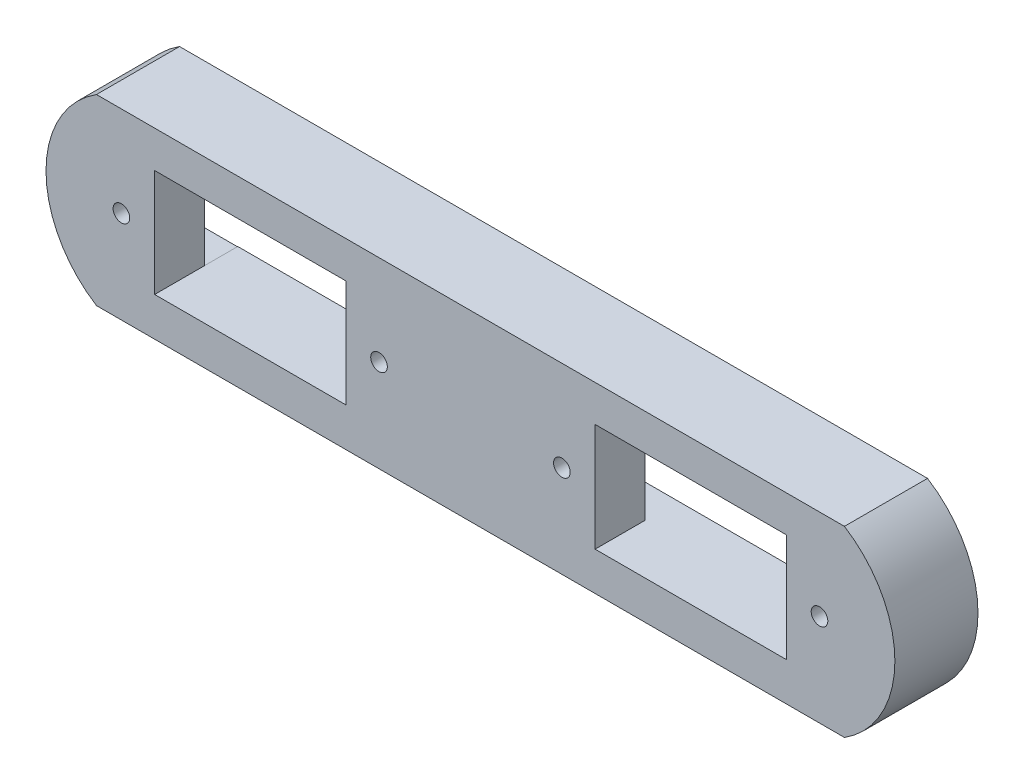
ISO-10303-21;
HEADER;
FILE_DESCRIPTION(('STEP AP214'),'2;1');
FILE_NAME('part.step','',(''),(''),'','','');
FILE_SCHEMA(('AUTOMOTIVE_DESIGN { 1 0 10303 214 1 1 1 1 }'));
ENDSEC;
DATA;
#1=APPLICATION_CONTEXT('core data for automotive mechanical design processes');
#2=APPLICATION_PROTOCOL_DEFINITION('international standard','automotive_design',2000,#1);
#3=PRODUCT_CONTEXT('',#1,'mechanical');
#4=PRODUCT('Part','Part','',(#3));
#5=PRODUCT_RELATED_PRODUCT_CATEGORY('part','',(#4));
#6=PRODUCT_DEFINITION_FORMATION('','',#4);
#7=PRODUCT_DEFINITION_CONTEXT('part definition',#1,'design');
#8=PRODUCT_DEFINITION('design','',#6,#7);
#9=PRODUCT_DEFINITION_SHAPE('','',#8);
#10=(LENGTH_UNIT() NAMED_UNIT(*) SI_UNIT(.MILLI.,.METRE.));
#11=(NAMED_UNIT(*) PLANE_ANGLE_UNIT() SI_UNIT($,.RADIAN.));
#12=(NAMED_UNIT(*) SI_UNIT($,.STERADIAN.) SOLID_ANGLE_UNIT());
#13=UNCERTAINTY_MEASURE_WITH_UNIT(LENGTH_MEASURE(1.E-05),#10,'distance_accuracy_value','');
#14=(GEOMETRIC_REPRESENTATION_CONTEXT(3) GLOBAL_UNCERTAINTY_ASSIGNED_CONTEXT((#13)) GLOBAL_UNIT_ASSIGNED_CONTEXT((#10,
#11,#12)) REPRESENTATION_CONTEXT('',''));
#15=CARTESIAN_POINT('',(0.,0.,0.));
#16=DIRECTION('',(0.,0.,1.));
#17=DIRECTION('',(1.,0.,0.));
#18=AXIS2_PLACEMENT_3D('',#15,#16,#17);
#19=CARTESIAN_POINT('',(0.,0.,10.));
#20=DIRECTION('',(0.,0.,1.));
#21=DIRECTION('',(1.,0.,0.));
#22=AXIS2_PLACEMENT_3D('',#19,#20,#21);
#23=PLANE('',#22);
#24=CARTESIAN_POINT('',(1.,6.5,10.));
#25=DIRECTION('',(0.,0.,1.));
#26=DIRECTION('',(1.,0.,0.));
#27=AXIS2_PLACEMENT_3D('',#24,#25,#26);
#28=CIRCLE('',#27,1.);
#29=CARTESIAN_POINT('',(2.,6.5,10.));
#30=VERTEX_POINT('',#29);
#31=EDGE_CURVE('E631',#30,#30,#28,.T.);
#32=ORIENTED_EDGE('',*,*,#31,.F.);
#33=EDGE_LOOP('',(#32));
#34=FACE_BOUND('',#33,.T.);
#35=CARTESIAN_POINT('',(-52.,6.49999999999998,10.));
#36=DIRECTION('',(0.,0.,1.));
#37=DIRECTION('',(1.,0.,0.));
#38=AXIS2_PLACEMENT_3D('',#35,#36,#37);
#39=CIRCLE('',#38,0.999999999999998);
#40=CARTESIAN_POINT('',(-51.,6.49999999999998,10.));
#41=VERTEX_POINT('',#40);
#42=EDGE_CURVE('E255',#41,#41,#39,.T.);
#43=ORIENTED_EDGE('',*,*,#42,.F.);
#44=EDGE_LOOP('',(#43));
#45=FACE_BOUND('',#44,.T.);
#46=DIRECTION('',(-1.,0.,0.));
#47=VECTOR('',#46,1.);
#48=CARTESIAN_POINT('',(28.,0.,10.));
#49=LINE('',#48,#47);
#50=CARTESIAN_POINT('',(28.,0.,10.));
#51=VERTEX_POINT('',#50);
#52=CARTESIAN_POINT('',(5.,0.,10.));
#53=VERTEX_POINT('',#52);
#54=EDGE_CURVE('E230',#51,#53,#49,.T.);
#55=ORIENTED_EDGE('',*,*,#54,.T.);
#56=DIRECTION('',(0.,-1.,0.));
#57=VECTOR('',#56,1.);
#58=CARTESIAN_POINT('',(5.,13.,10.));
#59=LINE('',#58,#57);
#60=CARTESIAN_POINT('',(5.,13.,10.));
#61=VERTEX_POINT('',#60);
#62=EDGE_CURVE('E216',#61,#53,#59,.T.);
#63=ORIENTED_EDGE('',*,*,#62,.F.);
#64=DIRECTION('',(-1.,0.,0.));
#65=VECTOR('',#64,1.);
#66=CARTESIAN_POINT('',(28.,13.,10.));
#67=LINE('',#66,#65);
#68=CARTESIAN_POINT('',(28.,13.,10.));
#69=VERTEX_POINT('',#68);
#70=EDGE_CURVE('E229',#69,#61,#67,.T.);
#71=ORIENTED_EDGE('',*,*,#70,.F.);
#72=DIRECTION('',(0.,-1.,0.));
#73=VECTOR('',#72,1.);
#74=CARTESIAN_POINT('',(28.,13.,10.));
#75=LINE('',#74,#73);
#76=EDGE_CURVE('E243',#69,#51,#75,.T.);
#77=ORIENTED_EDGE('',*,*,#76,.T.);
#78=EDGE_LOOP('',(#55,#63,#71,#77));
#79=FACE_BOUND('',#78,.T.);
#80=DIRECTION('',(-1.,0.,0.));
#81=VECTOR('',#80,1.);
#82=CARTESIAN_POINT('',(-25.,0.0411375071377396,10.));
#83=LINE('',#82,#81);
#84=CARTESIAN_POINT('',(-25.,0.0411375071377396,10.));
#85=VERTEX_POINT('',#84);
#86=CARTESIAN_POINT('',(-48.,0.0411375071377396,10.));
#87=VERTEX_POINT('',#86);
#88=EDGE_CURVE('E264',#85,#87,#83,.T.);
#89=ORIENTED_EDGE('',*,*,#88,.T.);
#90=DIRECTION('',(0.,-1.,0.));
#91=VECTOR('',#90,1.);
#92=CARTESIAN_POINT('',(-48.,12.9588624928623,10.));
#93=LINE('',#92,#91);
#94=CARTESIAN_POINT('',(-48.,12.9588624928623,10.));
#95=VERTEX_POINT('',#94);
#96=EDGE_CURVE('E300',#95,#87,#93,.T.);
#97=ORIENTED_EDGE('',*,*,#96,.F.);
#98=DIRECTION('',(-1.,0.,0.));
#99=VECTOR('',#98,1.);
#100=CARTESIAN_POINT('',(-25.,12.9588624928623,10.));
#101=LINE('',#100,#99);
#102=CARTESIAN_POINT('',(-25.,12.9588624928623,10.));
#103=VERTEX_POINT('',#102);
#104=EDGE_CURVE('E296',#103,#95,#101,.T.);
#105=ORIENTED_EDGE('',*,*,#104,.F.);
#106=DIRECTION('',(0.,-1.,0.));
#107=VECTOR('',#106,1.);
#108=CARTESIAN_POINT('',(-25.,12.9588624928623,10.));
#109=LINE('',#108,#107);
#110=EDGE_CURVE('E279',#103,#85,#109,.T.);
#111=ORIENTED_EDGE('',*,*,#110,.T.);
#112=EDGE_LOOP('',(#89,#97,#105,#111));
#113=FACE_BOUND('',#112,.T.);
#114=DIRECTION('',(1.,0.,0.));
#115=VECTOR('',#114,1.);
#116=CARTESIAN_POINT('',(0.,-4.62192193541233,10.));
#117=LINE('',#116,#115);
#118=CARTESIAN_POINT('',(-55.,-4.62192193541234,10.));
#119=VERTEX_POINT('',#118);
#120=CARTESIAN_POINT('',(35.,-4.62192193541233,10.));
#121=VERTEX_POINT('',#120);
#122=EDGE_CURVE('E458',#119,#121,#117,.T.);
#123=ORIENTED_EDGE('',*,*,#122,.T.);
#124=CARTESIAN_POINT('',(28.0717967697245,6.37807806458767,10.));
#125=DIRECTION('',(0.,0.,1.));
#126=DIRECTION('',(1.,0.,0.));
#127=AXIS2_PLACEMENT_3D('',#124,#125,#126);
#128=CIRCLE('',#127,13.);
#129=CARTESIAN_POINT('',(35.,17.3780780645877,10.));
#130=VERTEX_POINT('',#129);
#131=EDGE_CURVE('E461',#130,#121,#128,.F.);
#132=ORIENTED_EDGE('',*,*,#131,.F.);
#133=DIRECTION('',(1.,0.,0.));
#134=VECTOR('',#133,1.);
#135=CARTESIAN_POINT('',(0.,17.3780780645877,10.));
#136=LINE('',#135,#134);
#137=CARTESIAN_POINT('',(-55.,17.3780780645877,10.));
#138=VERTEX_POINT('',#137);
#139=EDGE_CURVE('E466',#138,#130,#136,.T.);
#140=ORIENTED_EDGE('',*,*,#139,.F.);
#141=CARTESIAN_POINT('',(-48.0717967697245,6.37807806458766,10.));
#142=DIRECTION('',(0.,0.,1.));
#143=DIRECTION('',(1.,0.,0.));
#144=AXIS2_PLACEMENT_3D('',#141,#142,#143);
#145=CIRCLE('',#144,13.);
#146=EDGE_CURVE('E470',#138,#119,#145,.T.);
#147=ORIENTED_EDGE('',*,*,#146,.T.);
#148=EDGE_LOOP('',(#123,#132,#140,#147));
#149=FACE_BOUND('',#148,.T.);
#150=CARTESIAN_POINT('',(-21.,6.5,10.));
#151=DIRECTION('',(0.,0.,-1.));
#152=DIRECTION('',(-1.,0.,0.));
#153=AXIS2_PLACEMENT_3D('',#150,#151,#152);
#154=CIRCLE('',#153,1.);
#155=CARTESIAN_POINT('',(-22.,6.5,10.));
#156=VERTEX_POINT('',#155);
#157=EDGE_CURVE('E626',#156,#156,#154,.T.);
#158=ORIENTED_EDGE('',*,*,#157,.T.);
#159=EDGE_LOOP('',(#158));
#160=FACE_BOUND('',#159,.T.);
#161=CARTESIAN_POINT('',(32.,6.5,10.));
#162=DIRECTION('',(0.,0.,-1.));
#163=DIRECTION('',(-1.,0.,0.));
#164=AXIS2_PLACEMENT_3D('',#161,#162,#163);
#165=CIRCLE('',#164,1.);
#166=CARTESIAN_POINT('',(31.,6.5,10.));
#167=VERTEX_POINT('',#166);
#168=EDGE_CURVE('E500',#167,#167,#165,.T.);
#169=ORIENTED_EDGE('',*,*,#168,.T.);
#170=EDGE_LOOP('',(#169));
#171=FACE_BOUND('',#170,.T.);
#172=ADVANCED_FACE('F39',(#34,#45,#79,#113,#149,#160,#171),#23,.T.);
#173=CARTESIAN_POINT('',(-25.,13.,4.));
#174=DIRECTION('',(1.,0.,0.));
#175=DIRECTION('',(0.,0.,-1.));
#176=AXIS2_PLACEMENT_3D('',#173,#174,#175);
#177=PLANE('',#176);
#178=DIRECTION('',(0.,-1.,0.));
#179=VECTOR('',#178,1.);
#180=CARTESIAN_POINT('',(-25.,13.,4.));
#181=LINE('',#180,#179);
#182=CARTESIAN_POINT('',(-25.,13.,4.));
#183=VERTEX_POINT('',#182);
#184=CARTESIAN_POINT('',(-25.,12.9588624928623,4.));
#185=VERTEX_POINT('',#184);
#186=EDGE_CURVE('E411',#183,#185,#181,.T.);
#187=ORIENTED_EDGE('',*,*,#186,.T.);
#188=DIRECTION('',(0.,0.,-1.));
#189=VECTOR('',#188,1.);
#190=CARTESIAN_POINT('',(-25.,12.9588624928623,10.));
#191=LINE('',#190,#189);
#192=CARTESIAN_POINT('',(-25.,12.9588624928623,0.));
#193=VERTEX_POINT('',#192);
#194=EDGE_CURVE('E288',#185,#193,#191,.T.);
#195=ORIENTED_EDGE('',*,*,#194,.T.);
#196=DIRECTION('',(0.,-1.,0.));
#197=VECTOR('',#196,1.);
#198=CARTESIAN_POINT('',(-25.,13.,0.));
#199=LINE('',#198,#197);
#200=CARTESIAN_POINT('',(-25.,13.,0.));
#201=VERTEX_POINT('',#200);
#202=EDGE_CURVE('E397',#201,#193,#199,.T.);
#203=ORIENTED_EDGE('',*,*,#202,.F.);
#204=DIRECTION('',(0.,0.,-1.));
#205=VECTOR('',#204,1.);
#206=CARTESIAN_POINT('',(-25.,13.,4.));
#207=LINE('',#206,#205);
#208=EDGE_CURVE('E377',#183,#201,#207,.T.);
#209=ORIENTED_EDGE('',*,*,#208,.F.);
#210=EDGE_LOOP('',(#187,#195,#203,#209));
#211=FACE_BOUND('',#210,.T.);
#212=ADVANCED_FACE('F568',(#211),#177,.T.);
#213=CARTESIAN_POINT('',(0.,-4.62192193541233,10.));
#214=DIRECTION('',(0.,1.,0.));
#215=DIRECTION('',(-1.,0.,0.));
#216=AXIS2_PLACEMENT_3D('',#213,#214,#215);
#217=PLANE('',#216);
#218=DIRECTION('',(1.,0.,0.));
#219=VECTOR('',#218,1.);
#220=CARTESIAN_POINT('',(0.,-4.62192193541233,0.));
#221=LINE('',#220,#219);
#222=CARTESIAN_POINT('',(-55.,-4.62192193541234,0.));
#223=VERTEX_POINT('',#222);
#224=CARTESIAN_POINT('',(35.,-4.62192193541233,0.));
#225=VERTEX_POINT('',#224);
#226=EDGE_CURVE('E338',#223,#225,#221,.T.);
#227=ORIENTED_EDGE('',*,*,#226,.T.);
#228=DIRECTION('',(0.,0.,-1.));
#229=VECTOR('',#228,1.);
#230=CARTESIAN_POINT('',(35.,-4.62192193541233,10.));
#231=LINE('',#230,#229);
#232=EDGE_CURVE('E11',#121,#225,#231,.T.);
#233=ORIENTED_EDGE('',*,*,#232,.F.);
#234=ORIENTED_EDGE('',*,*,#122,.F.);
#235=DIRECTION('',(0.,0.,-1.));
#236=VECTOR('',#235,1.);
#237=CARTESIAN_POINT('',(-55.,-4.62192193541234,10.));
#238=LINE('',#237,#236);
#239=EDGE_CURVE('E473',#119,#223,#238,.T.);
#240=ORIENTED_EDGE('',*,*,#239,.T.);
#241=EDGE_LOOP('',(#227,#233,#234,#240));
#242=FACE_BOUND('',#241,.T.);
#243=ADVANCED_FACE('F41',(#242),#217,.F.);
#244=CARTESIAN_POINT('',(28.0717967697245,6.37807806458767,10.));
#245=DIRECTION('',(0.,0.,-1.));
#246=DIRECTION('',(-1.,0.,0.));
#247=AXIS2_PLACEMENT_3D('',#244,#245,#246);
#248=CYLINDRICAL_SURFACE('',#247,13.);
#249=CARTESIAN_POINT('',(28.0717967697245,6.37807806458767,0.));
#250=DIRECTION('',(0.,0.,1.));
#251=DIRECTION('',(1.,0.,0.));
#252=AXIS2_PLACEMENT_3D('',#249,#250,#251);
#253=CIRCLE('',#252,13.);
#254=CARTESIAN_POINT('',(35.,17.3780780645877,0.));
#255=VERTEX_POINT('',#254);
#256=EDGE_CURVE('E477',#255,#225,#253,.F.);
#257=ORIENTED_EDGE('',*,*,#256,.F.);
#258=DIRECTION('',(0.,0.,-1.));
#259=VECTOR('',#258,1.);
#260=CARTESIAN_POINT('',(35.,17.3780780645877,10.));
#261=LINE('',#260,#259);
#262=EDGE_CURVE('E49',#130,#255,#261,.T.);
#263=ORIENTED_EDGE('',*,*,#262,.F.);
#264=ORIENTED_EDGE('',*,*,#131,.T.);
#265=ORIENTED_EDGE('',*,*,#232,.T.);
#266=EDGE_LOOP('',(#257,#263,#264,#265));
#267=FACE_BOUND('',#266,.T.);
#268=ADVANCED_FACE('F575',(#267),#248,.T.);
#269=CARTESIAN_POINT('',(0.,17.3780780645877,10.));
#270=DIRECTION('',(0.,1.,0.));
#271=DIRECTION('',(-1.,0.,0.));
#272=AXIS2_PLACEMENT_3D('',#269,#270,#271);
#273=PLANE('',#272);
#274=DIRECTION('',(1.,0.,0.));
#275=VECTOR('',#274,1.);
#276=CARTESIAN_POINT('',(0.,17.3780780645877,0.));
#277=LINE('',#276,#275);
#278=CARTESIAN_POINT('',(-55.,17.3780780645877,0.));
#279=VERTEX_POINT('',#278);
#280=EDGE_CURVE('E481',#279,#255,#277,.T.);
#281=ORIENTED_EDGE('',*,*,#280,.F.);
#282=DIRECTION('',(0.,0.,-1.));
#283=VECTOR('',#282,1.);
#284=CARTESIAN_POINT('',(-55.,17.3780780645877,10.));
#285=LINE('',#284,#283);
#286=EDGE_CURVE('E490',#138,#279,#285,.T.);
#287=ORIENTED_EDGE('',*,*,#286,.F.);
#288=ORIENTED_EDGE('',*,*,#139,.T.);
#289=ORIENTED_EDGE('',*,*,#262,.T.);
#290=EDGE_LOOP('',(#281,#287,#288,#289));
#291=FACE_BOUND('',#290,.T.);
#292=ADVANCED_FACE('F604',(#291),#273,.T.);
#293=CARTESIAN_POINT('',(-48.0717967697245,6.37807806458766,10.));
#294=DIRECTION('',(0.,0.,-1.));
#295=DIRECTION('',(-1.,0.,0.));
#296=AXIS2_PLACEMENT_3D('',#293,#294,#295);
#297=CYLINDRICAL_SURFACE('',#296,13.);
#298=CARTESIAN_POINT('',(-48.0717967697245,6.37807806458766,0.));
#299=DIRECTION('',(0.,0.,1.));
#300=DIRECTION('',(1.,0.,0.));
#301=AXIS2_PLACEMENT_3D('',#298,#299,#300);
#302=CIRCLE('',#301,13.);
#303=EDGE_CURVE('E462',#279,#223,#302,.T.);
#304=ORIENTED_EDGE('',*,*,#303,.T.);
#305=ORIENTED_EDGE('',*,*,#239,.F.);
#306=ORIENTED_EDGE('',*,*,#146,.F.);
#307=ORIENTED_EDGE('',*,*,#286,.T.);
#308=EDGE_LOOP('',(#304,#305,#306,#307));
#309=FACE_BOUND('',#308,.T.);
#310=ADVANCED_FACE('F600',(#309),#297,.T.);
#311=CARTESIAN_POINT('',(0.,0.,0.));
#312=DIRECTION('',(0.,0.,1.));
#313=DIRECTION('',(1.,0.,0.));
#314=AXIS2_PLACEMENT_3D('',#311,#312,#313);
#315=PLANE('',#314);
#316=DIRECTION('',(-1.,0.,0.));
#317=VECTOR('',#316,1.);
#318=CARTESIAN_POINT('',(5.,0.,0.));
#319=LINE('',#318,#317);
#320=CARTESIAN_POINT('',(28.,0.,0.));
#321=VERTEX_POINT('',#320);
#322=CARTESIAN_POINT('',(0.,0.,0.));
#323=VERTEX_POINT('',#322);
#324=EDGE_CURVE('E329',#321,#323,#319,.T.);
#325=ORIENTED_EDGE('',*,*,#324,.F.);
#326=DIRECTION('',(0.,-1.,0.));
#327=VECTOR('',#326,1.);
#328=CARTESIAN_POINT('',(28.,13.,0.));
#329=LINE('',#328,#327);
#330=CARTESIAN_POINT('',(28.,0.041137507137752,0.));
#331=VERTEX_POINT('',#330);
#332=EDGE_CURVE('E248',#331,#321,#329,.T.);
#333=ORIENTED_EDGE('',*,*,#332,.F.);
#334=DIRECTION('',(-1.,0.,0.));
#335=VECTOR('',#334,1.);
#336=CARTESIAN_POINT('',(33.,0.0411375071377517,0.));
#337=LINE('',#336,#335);
#338=CARTESIAN_POINT('',(33.,0.0411375071377517,0.));
#339=VERTEX_POINT('',#338);
#340=EDGE_CURVE('E324',#339,#331,#337,.T.);
#341=ORIENTED_EDGE('',*,*,#340,.F.);
#342=DIRECTION('',(0.,-1.,0.));
#343=VECTOR('',#342,1.);
#344=CARTESIAN_POINT('',(33.,13.,0.));
#345=LINE('',#344,#343);
#346=CARTESIAN_POINT('',(33.,13.,0.));
#347=VERTEX_POINT('',#346);
#348=EDGE_CURVE('E311',#347,#339,#345,.T.);
#349=ORIENTED_EDGE('',*,*,#348,.F.);
#350=DIRECTION('',(-1.,0.,0.));
#351=VECTOR('',#350,1.);
#352=CARTESIAN_POINT('',(33.,13.,0.));
#353=LINE('',#352,#351);
#354=CARTESIAN_POINT('',(5.,13.,0.));
#355=VERTEX_POINT('',#354);
#356=EDGE_CURVE('E328',#347,#355,#353,.T.);
#357=ORIENTED_EDGE('',*,*,#356,.T.);
#358=DIRECTION('',(0.,-1.,0.));
#359=VECTOR('',#358,1.);
#360=CARTESIAN_POINT('',(5.,13.,0.));
#361=LINE('',#360,#359);
#362=CARTESIAN_POINT('',(5.,12.9588624928623,0.));
#363=VERTEX_POINT('',#362);
#364=EDGE_CURVE('E252',#355,#363,#361,.T.);
#365=ORIENTED_EDGE('',*,*,#364,.T.);
#366=DIRECTION('',(-1.,0.,0.));
#367=VECTOR('',#366,1.);
#368=CARTESIAN_POINT('',(5.,12.9588624928623,0.));
#369=LINE('',#368,#367);
#370=CARTESIAN_POINT('',(0.,12.9588624928623,0.));
#371=VERTEX_POINT('',#370);
#372=EDGE_CURVE('E356',#363,#371,#369,.T.);
#373=ORIENTED_EDGE('',*,*,#372,.T.);
#374=DIRECTION('',(0.,-1.,0.));
#375=VECTOR('',#374,1.);
#376=CARTESIAN_POINT('',(0.,12.9588624928623,0.));
#377=LINE('',#376,#375);
#378=EDGE_CURVE('E360',#371,#323,#377,.T.);
#379=ORIENTED_EDGE('',*,*,#378,.T.);
#380=EDGE_LOOP('',(#325,#333,#341,#349,#357,#365,#373,#379));
#381=FACE_BOUND('',#380,.T.);
#382=DIRECTION('',(0.,-1.,0.));
#383=VECTOR('',#382,1.);
#384=CARTESIAN_POINT('',(-48.,12.9588624928623,0.));
#385=LINE('',#384,#383);
#386=CARTESIAN_POINT('',(-48.,0.0411375071377396,0.));
#387=VERTEX_POINT('',#386);
#388=CARTESIAN_POINT('',(-48.,0.,0.));
#389=VERTEX_POINT('',#388);
#390=EDGE_CURVE('E429',#387,#389,#385,.T.);
#391=ORIENTED_EDGE('',*,*,#390,.F.);
#392=DIRECTION('',(-1.,0.,0.));
#393=VECTOR('',#392,1.);
#394=CARTESIAN_POINT('',(-20.,0.0411375071377409,0.));
#395=LINE('',#394,#393);
#396=CARTESIAN_POINT('',(-20.,0.0411375071377409,0.));
#397=VERTEX_POINT('',#396);
#398=EDGE_CURVE('E355',#397,#387,#395,.T.);
#399=ORIENTED_EDGE('',*,*,#398,.F.);
#400=DIRECTION('',(0.,-1.,0.));
#401=VECTOR('',#400,1.);
#402=CARTESIAN_POINT('',(-20.,13.,0.));
#403=LINE('',#402,#401);
#404=CARTESIAN_POINT('',(-20.,13.,0.));
#405=VERTEX_POINT('',#404);
#406=EDGE_CURVE('E389',#405,#397,#403,.T.);
#407=ORIENTED_EDGE('',*,*,#406,.F.);
#408=DIRECTION('',(-1.,0.,0.));
#409=VECTOR('',#408,1.);
#410=CARTESIAN_POINT('',(-20.,13.,0.));
#411=LINE('',#410,#409);
#412=EDGE_CURVE('E392',#405,#201,#411,.T.);
#413=ORIENTED_EDGE('',*,*,#412,.T.);
#414=ORIENTED_EDGE('',*,*,#202,.T.);
#415=DIRECTION('',(-1.,0.,0.));
#416=VECTOR('',#415,1.);
#417=CARTESIAN_POINT('',(-48.,12.9588624928623,0.));
#418=LINE('',#417,#416);
#419=CARTESIAN_POINT('',(-53.,12.9588624928623,0.));
#420=VERTEX_POINT('',#419);
#421=EDGE_CURVE('E432',#193,#420,#418,.T.);
#422=ORIENTED_EDGE('',*,*,#421,.T.);
#423=DIRECTION('',(0.,-1.,0.));
#424=VECTOR('',#423,1.);
#425=CARTESIAN_POINT('',(-53.,12.9588624928623,0.));
#426=LINE('',#425,#424);
#427=CARTESIAN_POINT('',(-53.,0.,0.));
#428=VERTEX_POINT('',#427);
#429=EDGE_CURVE('E437',#420,#428,#426,.T.);
#430=ORIENTED_EDGE('',*,*,#429,.T.);
#431=DIRECTION('',(-1.,0.,0.));
#432=VECTOR('',#431,1.);
#433=CARTESIAN_POINT('',(-48.,0.,0.));
#434=LINE('',#433,#432);
#435=EDGE_CURVE('E388',#389,#428,#434,.T.);
#436=ORIENTED_EDGE('',*,*,#435,.F.);
#437=EDGE_LOOP('',(#391,#399,#407,#413,#414,#422,#430,#436));
#438=FACE_BOUND('',#437,.T.);
#439=ORIENTED_EDGE('',*,*,#226,.F.);
#440=ORIENTED_EDGE('',*,*,#303,.F.);
#441=ORIENTED_EDGE('',*,*,#280,.T.);
#442=ORIENTED_EDGE('',*,*,#256,.T.);
#443=EDGE_LOOP('',(#439,#440,#441,#442));
#444=FACE_BOUND('',#443,.T.);
#445=ADVANCED_FACE('F520',(#381,#438,#444),#315,.F.);
#446=CARTESIAN_POINT('',(-48.,0.,4.));
#447=DIRECTION('',(0.,-1.,0.));
#448=DIRECTION('',(0.,0.,-1.));
#449=AXIS2_PLACEMENT_3D('',#446,#447,#448);
#450=PLANE('',#449);
#451=ORIENTED_EDGE('',*,*,#435,.T.);
#452=DIRECTION('',(0.,0.,-1.));
#453=VECTOR('',#452,1.);
#454=CARTESIAN_POINT('',(-53.,0.,4.));
#455=LINE('',#454,#453);
#456=CARTESIAN_POINT('',(-53.,0.,4.));
#457=VERTEX_POINT('',#456);
#458=EDGE_CURVE('E418',#457,#428,#455,.T.);
#459=ORIENTED_EDGE('',*,*,#458,.F.);
#460=DIRECTION('',(-1.,0.,0.));
#461=VECTOR('',#460,1.);
#462=CARTESIAN_POINT('',(-48.,0.,4.));
#463=LINE('',#462,#461);
#464=CARTESIAN_POINT('',(-48.,0.,4.));
#465=VERTEX_POINT('',#464);
#466=EDGE_CURVE('E433',#465,#457,#463,.T.);
#467=ORIENTED_EDGE('',*,*,#466,.F.);
#468=DIRECTION('',(0.,0.,-1.));
#469=VECTOR('',#468,1.);
#470=CARTESIAN_POINT('',(-48.,0.,4.));
#471=LINE('',#470,#469);
#472=EDGE_CURVE('E269',#465,#389,#471,.T.);
#473=ORIENTED_EDGE('',*,*,#472,.T.);
#474=EDGE_LOOP('',(#451,#459,#467,#473));
#475=FACE_BOUND('',#474,.T.);
#476=ADVANCED_FACE('F526',(#475),#450,.F.);
#477=CARTESIAN_POINT('',(-48.,12.9588624928623,4.));
#478=DIRECTION('',(1.,0.,0.));
#479=DIRECTION('',(0.,0.,-1.));
#480=AXIS2_PLACEMENT_3D('',#477,#478,#479);
#481=PLANE('',#480);
#482=DIRECTION('',(0.,-1.,0.));
#483=VECTOR('',#482,1.);
#484=CARTESIAN_POINT('',(-48.,12.9588624928623,4.));
#485=LINE('',#484,#483);
#486=CARTESIAN_POINT('',(-48.,0.0411375071377396,4.));
#487=VERTEX_POINT('',#486);
#488=EDGE_CURVE('E422',#487,#465,#485,.T.);
#489=ORIENTED_EDGE('',*,*,#488,.F.);
#490=DIRECTION('',(0.,0.,-1.));
#491=VECTOR('',#490,1.);
#492=CARTESIAN_POINT('',(-48.,0.0411375071377396,10.));
#493=LINE('',#492,#491);
#494=EDGE_CURVE('E280',#487,#387,#493,.T.);
#495=ORIENTED_EDGE('',*,*,#494,.T.);
#496=ORIENTED_EDGE('',*,*,#390,.T.);
#497=ORIENTED_EDGE('',*,*,#472,.F.);
#498=EDGE_LOOP('',(#489,#495,#496,#497));
#499=FACE_BOUND('',#498,.T.);
#500=ADVANCED_FACE('F513',(#499),#481,.F.);
#501=CARTESIAN_POINT('',(-48.,12.9588624928623,4.));
#502=DIRECTION('',(0.,-1.,0.));
#503=DIRECTION('',(0.,0.,-1.));
#504=AXIS2_PLACEMENT_3D('',#501,#502,#503);
#505=PLANE('',#504);
#506=ORIENTED_EDGE('',*,*,#421,.F.);
#507=ORIENTED_EDGE('',*,*,#194,.F.);
#508=EDGE_CURVE('E285',#103,#185,#191,.T.);
#509=ORIENTED_EDGE('',*,*,#508,.F.);
#510=ORIENTED_EDGE('',*,*,#104,.T.);
#511=DIRECTION('',(0.,0.,-1.));
#512=VECTOR('',#511,1.);
#513=CARTESIAN_POINT('',(-48.,12.9588624928623,10.));
#514=LINE('',#513,#512);
#515=CARTESIAN_POINT('',(-48.,12.9588624928623,4.));
#516=VERTEX_POINT('',#515);
#517=EDGE_CURVE('E281',#95,#516,#514,.T.);
#518=ORIENTED_EDGE('',*,*,#517,.T.);
#519=DIRECTION('',(-1.,0.,0.));
#520=VECTOR('',#519,1.);
#521=CARTESIAN_POINT('',(-48.,12.9588624928623,4.));
#522=LINE('',#521,#520);
#523=CARTESIAN_POINT('',(-53.,12.9588624928623,4.));
#524=VERTEX_POINT('',#523);
#525=EDGE_CURVE('E447',#516,#524,#522,.T.);
#526=ORIENTED_EDGE('',*,*,#525,.T.);
#527=DIRECTION('',(0.,0.,-1.));
#528=VECTOR('',#527,1.);
#529=CARTESIAN_POINT('',(-53.,12.9588624928623,4.));
#530=LINE('',#529,#528);
#531=EDGE_CURVE('E423',#524,#420,#530,.T.);
#532=ORIENTED_EDGE('',*,*,#531,.T.);
#533=EDGE_LOOP('',(#506,#507,#509,#510,#518,#526,#532));
#534=FACE_BOUND('',#533,.T.);
#535=ADVANCED_FACE('F541',(#534),#505,.T.);
#536=CARTESIAN_POINT('',(-53.,12.9588624928623,4.));
#537=DIRECTION('',(1.,0.,0.));
#538=DIRECTION('',(0.,0.,-1.));
#539=AXIS2_PLACEMENT_3D('',#536,#537,#538);
#540=PLANE('',#539);
#541=DIRECTION('',(0.,-1.,0.));
#542=VECTOR('',#541,1.);
#543=CARTESIAN_POINT('',(-53.,12.9588624928623,4.));
#544=LINE('',#543,#542);
#545=CARTESIAN_POINT('',(-53.,6.49999999999998,4.));
#546=VERTEX_POINT('',#545);
#547=EDGE_CURVE('E451',#524,#546,#544,.T.);
#548=ORIENTED_EDGE('',*,*,#547,.T.);
#549=EDGE_CURVE('E450',#546,#457,#544,.T.);
#550=ORIENTED_EDGE('',*,*,#549,.T.);
#551=ORIENTED_EDGE('',*,*,#458,.T.);
#552=ORIENTED_EDGE('',*,*,#429,.F.);
#553=ORIENTED_EDGE('',*,*,#531,.F.);
#554=EDGE_LOOP('',(#548,#550,#551,#552,#553));
#555=FACE_BOUND('',#554,.T.);
#556=ADVANCED_FACE('F529',(#555),#540,.T.);
#557=CARTESIAN_POINT('',(0.,0.,4.));
#558=DIRECTION('',(0.,0.,1.));
#559=DIRECTION('',(1.,0.,0.));
#560=AXIS2_PLACEMENT_3D('',#557,#558,#559);
#561=PLANE('',#560);
#562=ORIENTED_EDGE('',*,*,#549,.F.);
#563=CARTESIAN_POINT('',(-52.,6.49999999999998,4.));
#564=DIRECTION('',(0.,0.,1.));
#565=DIRECTION('',(1.,0.,0.));
#566=AXIS2_PLACEMENT_3D('',#563,#564,#565);
#567=CIRCLE('',#566,0.999999999999998);
#568=EDGE_CURVE('E43',#546,#546,#567,.F.);
#569=ORIENTED_EDGE('',*,*,#568,.F.);
#570=ORIENTED_EDGE('',*,*,#547,.F.);
#571=ORIENTED_EDGE('',*,*,#525,.F.);
#572=EDGE_CURVE('E443',#516,#487,#485,.T.);
#573=ORIENTED_EDGE('',*,*,#572,.T.);
#574=ORIENTED_EDGE('',*,*,#488,.T.);
#575=ORIENTED_EDGE('',*,*,#466,.T.);
#576=EDGE_LOOP('',(#562,#569,#570,#571,#573,#574,#575));
#577=FACE_BOUND('',#576,.T.);
#578=ADVANCED_FACE('F536',(#577),#561,.F.);
#579=CARTESIAN_POINT('',(-20.,0.0411375071377409,4.));
#580=DIRECTION('',(0.,-1.,0.));
#581=DIRECTION('',(0.,0.,-1.));
#582=AXIS2_PLACEMENT_3D('',#579,#580,#581);
#583=PLANE('',#582);
#584=ORIENTED_EDGE('',*,*,#398,.T.);
#585=ORIENTED_EDGE('',*,*,#494,.F.);
#586=EDGE_CURVE('E275',#87,#487,#493,.T.);
#587=ORIENTED_EDGE('',*,*,#586,.F.);
#588=ORIENTED_EDGE('',*,*,#88,.F.);
#589=DIRECTION('',(0.,0.,-1.));
#590=VECTOR('',#589,1.);
#591=CARTESIAN_POINT('',(-25.,0.0411375071377396,10.));
#592=LINE('',#591,#590);
#593=CARTESIAN_POINT('',(-25.,0.0411375071377396,4.));
#594=VERTEX_POINT('',#593);
#595=EDGE_CURVE('E289',#85,#594,#592,.T.);
#596=ORIENTED_EDGE('',*,*,#595,.T.);
#597=DIRECTION('',(-1.,0.,0.));
#598=VECTOR('',#597,1.);
#599=CARTESIAN_POINT('',(-20.,0.0411375071377409,4.));
#600=LINE('',#599,#598);
#601=CARTESIAN_POINT('',(-20.,0.0411375071377409,4.));
#602=VERTEX_POINT('',#601);
#603=EDGE_CURVE('E393',#602,#594,#600,.T.);
#604=ORIENTED_EDGE('',*,*,#603,.F.);
#605=DIRECTION('',(0.,0.,-1.));
#606=VECTOR('',#605,1.);
#607=CARTESIAN_POINT('',(-20.,0.0411375071377409,4.));
#608=LINE('',#607,#606);
#609=EDGE_CURVE('E384',#602,#397,#608,.T.);
#610=ORIENTED_EDGE('',*,*,#609,.T.);
#611=EDGE_LOOP('',(#584,#585,#587,#588,#596,#604,#610));
#612=FACE_BOUND('',#611,.T.);
#613=ADVANCED_FACE('F548',(#612),#583,.F.);
#614=CARTESIAN_POINT('',(-20.,13.,4.));
#615=DIRECTION('',(1.,0.,0.));
#616=DIRECTION('',(0.,0.,-1.));
#617=AXIS2_PLACEMENT_3D('',#614,#615,#616);
#618=PLANE('',#617);
#619=DIRECTION('',(0.,-1.,0.));
#620=VECTOR('',#619,1.);
#621=CARTESIAN_POINT('',(-20.,13.,4.));
#622=LINE('',#621,#620);
#623=CARTESIAN_POINT('',(-20.,6.5,4.));
#624=VERTEX_POINT('',#623);
#625=EDGE_CURVE('E380',#624,#602,#622,.T.);
#626=ORIENTED_EDGE('',*,*,#625,.F.);
#627=CARTESIAN_POINT('',(-20.,13.,4.));
#628=VERTEX_POINT('',#627);
#629=EDGE_CURVE('E403',#628,#624,#622,.T.);
#630=ORIENTED_EDGE('',*,*,#629,.F.);
#631=DIRECTION('',(0.,0.,-1.));
#632=VECTOR('',#631,1.);
#633=CARTESIAN_POINT('',(-20.,13.,4.));
#634=LINE('',#633,#632);
#635=EDGE_CURVE('E381',#628,#405,#634,.T.);
#636=ORIENTED_EDGE('',*,*,#635,.T.);
#637=ORIENTED_EDGE('',*,*,#406,.T.);
#638=ORIENTED_EDGE('',*,*,#609,.F.);
#639=EDGE_LOOP('',(#626,#630,#636,#637,#638));
#640=FACE_BOUND('',#639,.T.);
#641=ADVANCED_FACE('F560',(#640),#618,.F.);
#642=CARTESIAN_POINT('',(-20.,13.,4.));
#643=DIRECTION('',(0.,-1.,0.));
#644=DIRECTION('',(0.,0.,-1.));
#645=AXIS2_PLACEMENT_3D('',#642,#643,#644);
#646=PLANE('',#645);
#647=ORIENTED_EDGE('',*,*,#412,.F.);
#648=ORIENTED_EDGE('',*,*,#635,.F.);
#649=DIRECTION('',(-1.,0.,0.));
#650=VECTOR('',#649,1.);
#651=CARTESIAN_POINT('',(-20.,13.,4.));
#652=LINE('',#651,#650);
#653=EDGE_CURVE('E407',#628,#183,#652,.T.);
#654=ORIENTED_EDGE('',*,*,#653,.T.);
#655=ORIENTED_EDGE('',*,*,#208,.T.);
#656=EDGE_LOOP('',(#647,#648,#654,#655));
#657=FACE_BOUND('',#656,.T.);
#658=ADVANCED_FACE('F564',(#657),#646,.T.);
#659=CARTESIAN_POINT('',(0.,0.,4.));
#660=DIRECTION('',(0.,0.,1.));
#661=DIRECTION('',(1.,0.,0.));
#662=AXIS2_PLACEMENT_3D('',#659,#660,#661);
#663=PLANE('',#662);
#664=ORIENTED_EDGE('',*,*,#629,.T.);
#665=CARTESIAN_POINT('',(-21.,6.5,4.));
#666=DIRECTION('',(0.,0.,1.));
#667=DIRECTION('',(1.,0.,0.));
#668=AXIS2_PLACEMENT_3D('',#665,#666,#667);
#669=CIRCLE('',#668,1.);
#670=EDGE_CURVE('E59',#624,#624,#669,.T.);
#671=ORIENTED_EDGE('',*,*,#670,.T.);
#672=ORIENTED_EDGE('',*,*,#625,.T.);
#673=ORIENTED_EDGE('',*,*,#603,.T.);
#674=EDGE_CURVE('E410',#185,#594,#181,.T.);
#675=ORIENTED_EDGE('',*,*,#674,.F.);
#676=ORIENTED_EDGE('',*,*,#186,.F.);
#677=ORIENTED_EDGE('',*,*,#653,.F.);
#678=EDGE_LOOP('',(#664,#671,#672,#673,#675,#676,#677));
#679=FACE_BOUND('',#678,.T.);
#680=ADVANCED_FACE('F557',(#679),#663,.F.);
#681=CARTESIAN_POINT('',(5.,0.,4.));
#682=DIRECTION('',(0.,-1.,0.));
#683=DIRECTION('',(0.,0.,-1.));
#684=AXIS2_PLACEMENT_3D('',#681,#682,#683);
#685=PLANE('',#684);
#686=ORIENTED_EDGE('',*,*,#324,.T.);
#687=DIRECTION('',(0.,0.,-1.));
#688=VECTOR('',#687,1.);
#689=CARTESIAN_POINT('',(0.,0.,4.));
#690=LINE('',#689,#688);
#691=CARTESIAN_POINT('',(0.,0.,4.));
#692=VERTEX_POINT('',#691);
#693=EDGE_CURVE('E344',#692,#323,#690,.T.);
#694=ORIENTED_EDGE('',*,*,#693,.F.);
#695=DIRECTION('',(-1.,0.,0.));
#696=VECTOR('',#695,1.);
#697=CARTESIAN_POINT('',(5.,0.,4.));
#698=LINE('',#697,#696);
#699=CARTESIAN_POINT('',(5.,0.,4.));
#700=VERTEX_POINT('',#699);
#701=EDGE_CURVE('E240',#700,#692,#698,.T.);
#702=ORIENTED_EDGE('',*,*,#701,.F.);
#703=DIRECTION('',(0.,0.,-1.));
#704=VECTOR('',#703,1.);
#705=CARTESIAN_POINT('',(5.,0.,10.));
#706=LINE('',#705,#704);
#707=EDGE_CURVE('E220',#53,#700,#706,.T.);
#708=ORIENTED_EDGE('',*,*,#707,.F.);
#709=ORIENTED_EDGE('',*,*,#54,.F.);
#710=DIRECTION('',(0.,0.,-1.));
#711=VECTOR('',#710,1.);
#712=CARTESIAN_POINT('',(28.,0.,10.));
#713=LINE('',#712,#711);
#714=EDGE_CURVE('E266',#51,#321,#713,.T.);
#715=ORIENTED_EDGE('',*,*,#714,.T.);
#716=EDGE_LOOP('',(#686,#694,#702,#708,#709,#715));
#717=FACE_BOUND('',#716,.T.);
#718=ADVANCED_FACE('F235',(#717),#685,.F.);
#719=CARTESIAN_POINT('',(5.,12.9588624928623,4.));
#720=DIRECTION('',(0.,-1.,0.));
#721=DIRECTION('',(0.,0.,-1.));
#722=AXIS2_PLACEMENT_3D('',#719,#720,#721);
#723=PLANE('',#722);
#724=ORIENTED_EDGE('',*,*,#372,.F.);
#725=DIRECTION('',(0.,0.,-1.));
#726=VECTOR('',#725,1.);
#727=CARTESIAN_POINT('',(5.,12.9588624928623,4.));
#728=LINE('',#727,#726);
#729=CARTESIAN_POINT('',(5.,12.9588624928623,4.));
#730=VERTEX_POINT('',#729);
#731=EDGE_CURVE('E352',#730,#363,#728,.T.);
#732=ORIENTED_EDGE('',*,*,#731,.F.);
#733=DIRECTION('',(-1.,0.,0.));
#734=VECTOR('',#733,1.);
#735=CARTESIAN_POINT('',(5.,12.9588624928623,4.));
#736=LINE('',#735,#734);
#737=CARTESIAN_POINT('',(0.,12.9588624928623,4.));
#738=VERTEX_POINT('',#737);
#739=EDGE_CURVE('E367',#730,#738,#736,.T.);
#740=ORIENTED_EDGE('',*,*,#739,.T.);
#741=DIRECTION('',(0.,0.,-1.));
#742=VECTOR('',#741,1.);
#743=CARTESIAN_POINT('',(0.,12.9588624928623,4.));
#744=LINE('',#743,#742);
#745=EDGE_CURVE('E349',#738,#371,#744,.T.);
#746=ORIENTED_EDGE('',*,*,#745,.T.);
#747=EDGE_LOOP('',(#724,#732,#740,#746));
#748=FACE_BOUND('',#747,.T.);
#749=ADVANCED_FACE('F684',(#748),#723,.T.);
#750=CARTESIAN_POINT('',(0.,12.9588624928623,4.));
#751=DIRECTION('',(1.,0.,0.));
#752=DIRECTION('',(0.,0.,-1.));
#753=AXIS2_PLACEMENT_3D('',#750,#751,#752);
#754=PLANE('',#753);
#755=DIRECTION('',(0.,-1.,0.));
#756=VECTOR('',#755,1.);
#757=CARTESIAN_POINT('',(0.,12.9588624928623,4.));
#758=LINE('',#757,#756);
#759=CARTESIAN_POINT('',(0.,6.5,4.));
#760=VERTEX_POINT('',#759);
#761=EDGE_CURVE('E371',#738,#760,#758,.T.);
#762=ORIENTED_EDGE('',*,*,#761,.T.);
#763=EDGE_CURVE('E370',#760,#692,#758,.T.);
#764=ORIENTED_EDGE('',*,*,#763,.T.);
#765=ORIENTED_EDGE('',*,*,#693,.T.);
#766=ORIENTED_EDGE('',*,*,#378,.F.);
#767=ORIENTED_EDGE('',*,*,#745,.F.);
#768=EDGE_LOOP('',(#762,#764,#765,#766,#767));
#769=FACE_BOUND('',#768,.T.);
#770=ADVANCED_FACE('F685',(#769),#754,.T.);
#771=CARTESIAN_POINT('',(0.,0.,4.));
#772=DIRECTION('',(0.,0.,1.));
#773=DIRECTION('',(1.,0.,0.));
#774=AXIS2_PLACEMENT_3D('',#771,#772,#773);
#775=PLANE('',#774);
#776=ORIENTED_EDGE('',*,*,#763,.F.);
#777=CARTESIAN_POINT('',(1.,6.5,4.));
#778=DIRECTION('',(0.,0.,1.));
#779=DIRECTION('',(1.,0.,0.));
#780=AXIS2_PLACEMENT_3D('',#777,#778,#779);
#781=CIRCLE('',#780,1.);
#782=EDGE_CURVE('E499',#760,#760,#781,.F.);
#783=ORIENTED_EDGE('',*,*,#782,.F.);
#784=ORIENTED_EDGE('',*,*,#761,.F.);
#785=ORIENTED_EDGE('',*,*,#739,.F.);
#786=DIRECTION('',(0.,-1.,0.));
#787=VECTOR('',#786,1.);
#788=CARTESIAN_POINT('',(5.,12.9588624928623,4.));
#789=LINE('',#788,#787);
#790=EDGE_CURVE('E348',#730,#700,#789,.T.);
#791=ORIENTED_EDGE('',*,*,#790,.T.);
#792=ORIENTED_EDGE('',*,*,#701,.T.);
#793=EDGE_LOOP('',(#776,#783,#784,#785,#791,#792));
#794=FACE_BOUND('',#793,.T.);
#795=ADVANCED_FACE('F680',(#794),#775,.F.);
#796=CARTESIAN_POINT('',(33.,0.0411375071377517,4.));
#797=DIRECTION('',(0.,-1.,0.));
#798=DIRECTION('',(0.,0.,-1.));
#799=AXIS2_PLACEMENT_3D('',#796,#797,#798);
#800=PLANE('',#799);
#801=ORIENTED_EDGE('',*,*,#340,.T.);
#802=DIRECTION('',(0.,0.,-1.));
#803=VECTOR('',#802,1.);
#804=CARTESIAN_POINT('',(28.,0.0411375071377517,4.));
#805=LINE('',#804,#803);
#806=CARTESIAN_POINT('',(28.,0.0411375071377517,4.));
#807=VERTEX_POINT('',#806);
#808=EDGE_CURVE('E323',#807,#331,#805,.T.);
#809=ORIENTED_EDGE('',*,*,#808,.F.);
#810=DIRECTION('',(-1.,0.,0.));
#811=VECTOR('',#810,1.);
#812=CARTESIAN_POINT('',(33.,0.0411375071377517,4.));
#813=LINE('',#812,#811);
#814=CARTESIAN_POINT('',(33.,0.0411375071377517,4.));
#815=VERTEX_POINT('',#814);
#816=EDGE_CURVE('E306',#815,#807,#813,.T.);
#817=ORIENTED_EDGE('',*,*,#816,.F.);
#818=DIRECTION('',(0.,0.,-1.));
#819=VECTOR('',#818,1.);
#820=CARTESIAN_POINT('',(33.,0.0411375071377517,4.));
#821=LINE('',#820,#819);
#822=EDGE_CURVE('E334',#815,#339,#821,.T.);
#823=ORIENTED_EDGE('',*,*,#822,.T.);
#824=EDGE_LOOP('',(#801,#809,#817,#823));
#825=FACE_BOUND('',#824,.T.);
#826=ADVANCED_FACE('F673',(#825),#800,.F.);
#827=CARTESIAN_POINT('',(33.,13.,4.));
#828=DIRECTION('',(1.,0.,0.));
#829=DIRECTION('',(0.,0.,-1.));
#830=AXIS2_PLACEMENT_3D('',#827,#828,#829);
#831=PLANE('',#830);
#832=DIRECTION('',(0.,-1.,0.));
#833=VECTOR('',#832,1.);
#834=CARTESIAN_POINT('',(33.,13.,4.));
#835=LINE('',#834,#833);
#836=CARTESIAN_POINT('',(33.,6.5,4.));
#837=VERTEX_POINT('',#836);
#838=EDGE_CURVE('E318',#837,#815,#835,.T.);
#839=ORIENTED_EDGE('',*,*,#838,.F.);
#840=CARTESIAN_POINT('',(33.,13.,4.));
#841=VERTEX_POINT('',#840);
#842=EDGE_CURVE('E319',#841,#837,#835,.T.);
#843=ORIENTED_EDGE('',*,*,#842,.F.);
#844=DIRECTION('',(0.,0.,-1.));
#845=VECTOR('',#844,1.);
#846=CARTESIAN_POINT('',(33.,13.,4.));
#847=LINE('',#846,#845);
#848=EDGE_CURVE('E339',#841,#347,#847,.T.);
#849=ORIENTED_EDGE('',*,*,#848,.T.);
#850=ORIENTED_EDGE('',*,*,#348,.T.);
#851=ORIENTED_EDGE('',*,*,#822,.F.);
#852=EDGE_LOOP('',(#839,#843,#849,#850,#851));
#853=FACE_BOUND('',#852,.T.);
#854=ADVANCED_FACE('F670',(#853),#831,.F.);
#855=CARTESIAN_POINT('',(33.,13.,4.));
#856=DIRECTION('',(0.,-1.,0.));
#857=DIRECTION('',(0.,0.,-1.));
#858=AXIS2_PLACEMENT_3D('',#855,#856,#857);
#859=PLANE('',#858);
#860=ORIENTED_EDGE('',*,*,#356,.F.);
#861=ORIENTED_EDGE('',*,*,#848,.F.);
#862=DIRECTION('',(-1.,0.,0.));
#863=VECTOR('',#862,1.);
#864=CARTESIAN_POINT('',(33.,13.,4.));
#865=LINE('',#864,#863);
#866=CARTESIAN_POINT('',(28.,13.,4.));
#867=VERTEX_POINT('',#866);
#868=EDGE_CURVE('E314',#841,#867,#865,.T.);
#869=ORIENTED_EDGE('',*,*,#868,.T.);
#870=DIRECTION('',(0.,0.,-1.));
#871=VECTOR('',#870,1.);
#872=CARTESIAN_POINT('',(28.,13.,10.));
#873=LINE('',#872,#871);
#874=EDGE_CURVE('E270',#69,#867,#873,.T.);
#875=ORIENTED_EDGE('',*,*,#874,.F.);
#876=ORIENTED_EDGE('',*,*,#70,.T.);
#877=DIRECTION('',(0.,0.,-1.));
#878=VECTOR('',#877,1.);
#879=CARTESIAN_POINT('',(5.,13.,10.));
#880=LINE('',#879,#878);
#881=EDGE_CURVE('E223',#61,#355,#880,.T.);
#882=ORIENTED_EDGE('',*,*,#881,.T.);
#883=EDGE_LOOP('',(#860,#861,#869,#875,#876,#882));
#884=FACE_BOUND('',#883,.T.);
#885=ADVANCED_FACE('F668',(#884),#859,.T.);
#886=CARTESIAN_POINT('',(0.,0.,4.));
#887=DIRECTION('',(0.,0.,1.));
#888=DIRECTION('',(1.,0.,0.));
#889=AXIS2_PLACEMENT_3D('',#886,#887,#888);
#890=PLANE('',#889);
#891=ORIENTED_EDGE('',*,*,#842,.T.);
#892=CARTESIAN_POINT('',(32.,6.5,4.));
#893=DIRECTION('',(0.,0.,1.));
#894=DIRECTION('',(1.,0.,0.));
#895=AXIS2_PLACEMENT_3D('',#892,#893,#894);
#896=CIRCLE('',#895,1.);
#897=EDGE_CURVE('E495',#837,#837,#896,.T.);
#898=ORIENTED_EDGE('',*,*,#897,.T.);
#899=ORIENTED_EDGE('',*,*,#838,.T.);
#900=ORIENTED_EDGE('',*,*,#816,.T.);
#901=DIRECTION('',(0.,-1.,0.));
#902=VECTOR('',#901,1.);
#903=CARTESIAN_POINT('',(28.,13.,4.));
#904=LINE('',#903,#902);
#905=EDGE_CURVE('E310',#867,#807,#904,.T.);
#906=ORIENTED_EDGE('',*,*,#905,.F.);
#907=ORIENTED_EDGE('',*,*,#868,.F.);
#908=EDGE_LOOP('',(#891,#898,#899,#900,#906,#907));
#909=FACE_BOUND('',#908,.T.);
#910=ADVANCED_FACE('F657',(#909),#890,.F.);
#911=CARTESIAN_POINT('',(28.,13.,10.));
#912=DIRECTION('',(1.,0.,0.));
#913=DIRECTION('',(0.,0.,-1.));
#914=AXIS2_PLACEMENT_3D('',#911,#912,#913);
#915=PLANE('',#914);
#916=ORIENTED_EDGE('',*,*,#332,.T.);
#917=ORIENTED_EDGE('',*,*,#714,.F.);
#918=ORIENTED_EDGE('',*,*,#76,.F.);
#919=ORIENTED_EDGE('',*,*,#874,.T.);
#920=ORIENTED_EDGE('',*,*,#905,.T.);
#921=ORIENTED_EDGE('',*,*,#808,.T.);
#922=EDGE_LOOP('',(#916,#917,#918,#919,#920,#921));
#923=FACE_BOUND('',#922,.T.);
#924=ADVANCED_FACE('F654',(#923),#915,.F.);
#925=CARTESIAN_POINT('',(5.,13.,10.));
#926=DIRECTION('',(1.,0.,0.));
#927=DIRECTION('',(0.,0.,-1.));
#928=AXIS2_PLACEMENT_3D('',#925,#926,#927);
#929=PLANE('',#928);
#930=ORIENTED_EDGE('',*,*,#364,.F.);
#931=ORIENTED_EDGE('',*,*,#881,.F.);
#932=ORIENTED_EDGE('',*,*,#62,.T.);
#933=ORIENTED_EDGE('',*,*,#707,.T.);
#934=ORIENTED_EDGE('',*,*,#790,.F.);
#935=ORIENTED_EDGE('',*,*,#731,.T.);
#936=EDGE_LOOP('',(#930,#931,#932,#933,#934,#935));
#937=FACE_BOUND('',#936,.T.);
#938=ADVANCED_FACE('F219',(#937),#929,.T.);
#939=CARTESIAN_POINT('',(-48.,12.9588624928623,10.));
#940=DIRECTION('',(1.,0.,0.));
#941=DIRECTION('',(0.,0.,-1.));
#942=AXIS2_PLACEMENT_3D('',#939,#940,#941);
#943=PLANE('',#942);
#944=ORIENTED_EDGE('',*,*,#572,.F.);
#945=ORIENTED_EDGE('',*,*,#517,.F.);
#946=ORIENTED_EDGE('',*,*,#96,.T.);
#947=ORIENTED_EDGE('',*,*,#586,.T.);
#948=EDGE_LOOP('',(#944,#945,#946,#947));
#949=FACE_BOUND('',#948,.T.);
#950=ADVANCED_FACE('F539',(#949),#943,.T.);
#951=CARTESIAN_POINT('',(-25.,12.9588624928623,10.));
#952=DIRECTION('',(1.,0.,0.));
#953=DIRECTION('',(0.,0.,-1.));
#954=AXIS2_PLACEMENT_3D('',#951,#952,#953);
#955=PLANE('',#954);
#956=ORIENTED_EDGE('',*,*,#595,.F.);
#957=ORIENTED_EDGE('',*,*,#110,.F.);
#958=ORIENTED_EDGE('',*,*,#508,.T.);
#959=ORIENTED_EDGE('',*,*,#674,.T.);
#960=EDGE_LOOP('',(#956,#957,#958,#959));
#961=FACE_BOUND('',#960,.T.);
#962=ADVANCED_FACE('F551',(#961),#955,.F.);
#963=CARTESIAN_POINT('',(32.,6.5,10.));
#964=DIRECTION('',(0.,0.,-1.));
#965=DIRECTION('',(-1.,0.,0.));
#966=AXIS2_PLACEMENT_3D('',#963,#964,#965);
#967=CYLINDRICAL_SURFACE('',#966,1.);
#968=ORIENTED_EDGE('',*,*,#168,.F.);
#969=EDGE_LOOP('',(#968));
#970=FACE_BOUND('',#969,.T.);
#971=ORIENTED_EDGE('',*,*,#897,.F.);
#972=EDGE_LOOP('',(#971));
#973=FACE_BOUND('',#972,.T.);
#974=ADVANCED_FACE('F665',(#970,#973),#967,.F.);
#975=CARTESIAN_POINT('',(1.,6.5,10.));
#976=DIRECTION('',(0.,0.,-1.));
#977=DIRECTION('',(-1.,0.,0.));
#978=AXIS2_PLACEMENT_3D('',#975,#976,#977);
#979=CYLINDRICAL_SURFACE('',#978,1.);
#980=ORIENTED_EDGE('',*,*,#31,.T.);
#981=EDGE_LOOP('',(#980));
#982=FACE_BOUND('',#981,.T.);
#983=ORIENTED_EDGE('',*,*,#782,.T.);
#984=EDGE_LOOP('',(#983));
#985=FACE_BOUND('',#984,.T.);
#986=ADVANCED_FACE('F649',(#982,#985),#979,.F.);
#987=CARTESIAN_POINT('',(-21.,6.5,10.));
#988=DIRECTION('',(0.,0.,-1.));
#989=DIRECTION('',(-1.,0.,0.));
#990=AXIS2_PLACEMENT_3D('',#987,#988,#989);
#991=CYLINDRICAL_SURFACE('',#990,1.);
#992=ORIENTED_EDGE('',*,*,#157,.F.);
#993=EDGE_LOOP('',(#992));
#994=FACE_BOUND('',#993,.T.);
#995=ORIENTED_EDGE('',*,*,#670,.F.);
#996=EDGE_LOOP('',(#995));
#997=FACE_BOUND('',#996,.T.);
#998=ADVANCED_FACE('F644',(#994,#997),#991,.F.);
#999=CARTESIAN_POINT('',(-52.,6.49999999999998,10.));
#1000=DIRECTION('',(0.,0.,-1.));
#1001=DIRECTION('',(-1.,0.,0.));
#1002=AXIS2_PLACEMENT_3D('',#999,#1000,#1001);
#1003=CYLINDRICAL_SURFACE('',#1002,0.999999999999998);
#1004=ORIENTED_EDGE('',*,*,#42,.T.);
#1005=EDGE_LOOP('',(#1004));
#1006=FACE_BOUND('',#1005,.T.);
#1007=ORIENTED_EDGE('',*,*,#568,.T.);
#1008=EDGE_LOOP('',(#1007));
#1009=FACE_BOUND('',#1008,.T.);
#1010=ADVANCED_FACE('F641',(#1006,#1009),#1003,.F.);
#1011=CLOSED_SHELL('',(#172,#212,#243,#268,#292,#310,#445,#476,#500,#535,#556,#578,#613,#641,
#658,#680,#718,#749,#770,#795,#826,#854,#885,#910,#924,#938,#950,#962,#974,#986,#998,#1010));
#1012=MANIFOLD_SOLID_BREP('B2',#1011);
#1013=ADVANCED_BREP_SHAPE_REPRESENTATION('',(#18,#1012),#14);
#1014=SHAPE_DEFINITION_REPRESENTATION(#9,#1013);
ENDSEC;
END-ISO-10303-21;
